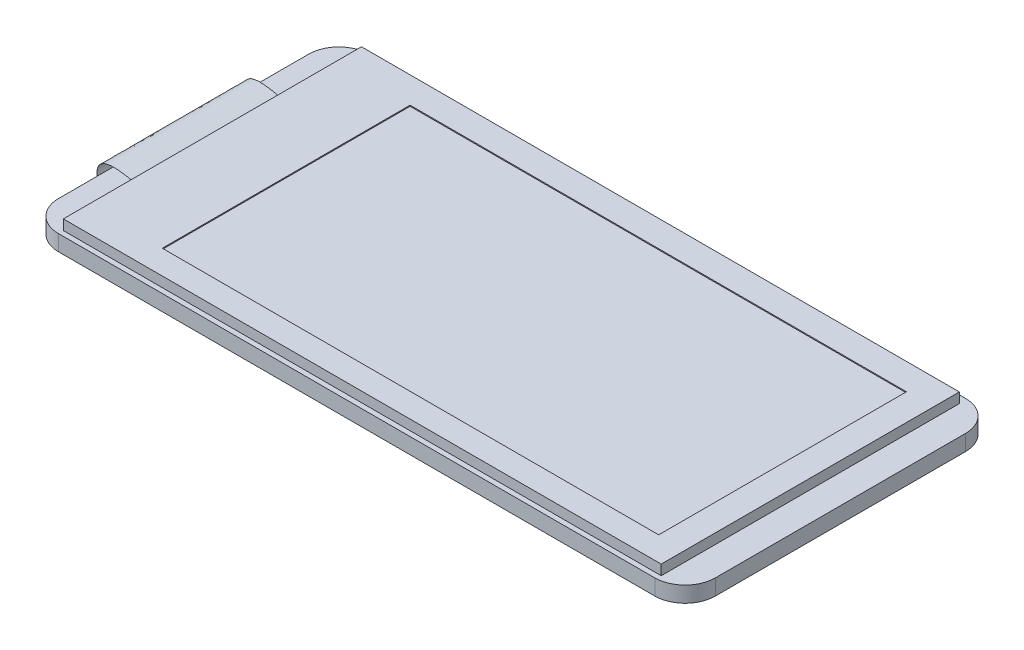
ISO-10303-21;
HEADER;
FILE_DESCRIPTION(('STEP AP214'),'2;1');
FILE_NAME('part.step','',(''),(''),'','','');
FILE_SCHEMA(('AUTOMOTIVE_DESIGN { 1 0 10303 214 1 1 1 1 }'));
ENDSEC;
DATA;
#1=APPLICATION_CONTEXT('core data for automotive mechanical design processes');
#2=APPLICATION_PROTOCOL_DEFINITION('international standard','automotive_design',2000,#1);
#3=PRODUCT_CONTEXT('',#1,'mechanical');
#4=PRODUCT('Part','Part','',(#3));
#5=PRODUCT_RELATED_PRODUCT_CATEGORY('part','',(#4));
#6=PRODUCT_DEFINITION_FORMATION('','',#4);
#7=PRODUCT_DEFINITION_CONTEXT('part definition',#1,'design');
#8=PRODUCT_DEFINITION('design','',#6,#7);
#9=PRODUCT_DEFINITION_SHAPE('','',#8);
#10=(LENGTH_UNIT() NAMED_UNIT(*) SI_UNIT(.MILLI.,.METRE.));
#11=(NAMED_UNIT(*) PLANE_ANGLE_UNIT() SI_UNIT($,.RADIAN.));
#12=(NAMED_UNIT(*) SI_UNIT($,.STERADIAN.) SOLID_ANGLE_UNIT());
#13=UNCERTAINTY_MEASURE_WITH_UNIT(LENGTH_MEASURE(1.E-05),#10,'distance_accuracy_value','');
#14=(GEOMETRIC_REPRESENTATION_CONTEXT(3) GLOBAL_UNCERTAINTY_ASSIGNED_CONTEXT((#13)) GLOBAL_UNIT_ASSIGNED_CONTEXT((#10,
#11,#12)) REPRESENTATION_CONTEXT('',''));
#15=CARTESIAN_POINT('',(0.,0.,0.));
#16=DIRECTION('',(0.,0.,1.));
#17=DIRECTION('',(1.,0.,0.));
#18=AXIS2_PLACEMENT_3D('',#15,#16,#17);
#19=CARTESIAN_POINT('',(-29.52,1.56,-7.125));
#20=CARTESIAN_POINT('',(-33.3668366075532,2.57445468199855,-7.21050303246677));
#21=CARTESIAN_POINT('',(-34.1351251703207,0.0224228326647486,-7.086887013733));
#22=CARTESIAN_POINT('',(-32.5097438643297,-0.863632860500111,-7.12662312440529));
#23=CARTESIAN_POINT('',(-29.5,2.68595234014289E-11,-7.375));
#24=CARTESIAN_POINT('',(-29.52,1.56,-2.29166666666667));
#25=CARTESIAN_POINT('',(-33.3668366075532,2.57445468199855,-2.3650742359035));
#26=CARTESIAN_POINT('',(-34.1351251703207,0.0224228326647486,-2.21368043939195));
#27=CARTESIAN_POINT('',(-32.5097438643297,-0.863632860500111,-2.22563877228647));
#28=CARTESIAN_POINT('',(-29.5,2.68595234014289E-11,-2.45833333333333));
#29=CARTESIAN_POINT('',(-29.52,1.56,2.54166666666666));
#30=CARTESIAN_POINT('',(-33.3668366075532,2.57445468199855,2.48035456065976));
#31=CARTESIAN_POINT('',(-34.1351251703207,0.0224228326647486,2.65952613494909));
#32=CARTESIAN_POINT('',(-32.5097438643297,-0.863632860500111,2.67534557983235));
#33=CARTESIAN_POINT('',(-29.5,2.68595234014289E-11,2.45833333333333));
#34=CARTESIAN_POINT('',(-29.52,1.56,7.375));
#35=CARTESIAN_POINT('',(-33.3668366075532,2.57445468199855,7.32578335722303));
#36=CARTESIAN_POINT('',(-34.1351251703207,0.0224228326647486,7.53273270929013));
#37=CARTESIAN_POINT('',(-32.5097438643297,-0.863632860500111,7.57632993195117));
#38=CARTESIAN_POINT('',(-29.5,2.68595234014289E-11,7.375));
#39=B_SPLINE_SURFACE_WITH_KNOTS('',3,3,((#19,#20,#21,#22,#23),(#24,#25,#26,#27,#28),(#29,#30,
#31,#32,#33),(#34,#35,#36,#37,#38)),.UNSPECIFIED.,.F.,.F.,.F.,(4,4),(4,1,4),(0.,1.),(0.,
0.435436676277593,1.),.UNSPECIFIED.);
#40=DIRECTION('',(0.,0.,1.));
#41=VECTOR('',#40,1.);
#42=CARTESIAN_POINT('',(-29.52,1.56,0.124999999999998));
#43=LINE('',#42,#41);
#44=CARTESIAN_POINT('',(-29.52,1.56,-7.125));
#45=VERTEX_POINT('',#44);
#46=CARTESIAN_POINT('',(-29.52,1.56,7.375));
#47=VERTEX_POINT('',#46);
#48=EDGE_CURVE('E13',#45,#47,#43,.T.);
#49=CARTESIAN_POINT('',(-29.52,1.56,7.375));
#50=CARTESIAN_POINT('',(-33.3668366075532,2.57445468199855,7.32578335722303));
#51=CARTESIAN_POINT('',(-34.1351251703207,0.0224228326647486,7.53273270929013));
#52=CARTESIAN_POINT('',(-32.5097438643297,-0.863632860500111,7.57632993195117));
#53=CARTESIAN_POINT('',(-29.5,2.68595234014289E-11,7.375));
#54=B_SPLINE_CURVE_WITH_KNOTS('',3,(#49,#50,#51,#52,#53),.UNSPECIFIED.,.F.,.F.,(4,1,4),(0.,
0.435436676277593,1.),.UNSPECIFIED.);
#55=CARTESIAN_POINT('',(-29.5,2.68595234014289E-11,7.375));
#56=VERTEX_POINT('',#55);
#57=EDGE_CURVE('E66',#47,#56,#54,.T.);
#58=DIRECTION('',(0.,0.,-1.));
#59=VECTOR('',#58,1.);
#60=CARTESIAN_POINT('',(-29.5,2.68595234014289E-11,0.));
#61=LINE('',#60,#59);
#62=CARTESIAN_POINT('',(-29.5,2.68595234014289E-11,-7.375));
#63=VERTEX_POINT('',#62);
#64=EDGE_CURVE('E60',#56,#63,#61,.T.);
#65=CARTESIAN_POINT('',(-29.52,1.56,-7.125));
#66=CARTESIAN_POINT('',(-33.3668366075532,2.57445468199855,-7.21050303246677));
#67=CARTESIAN_POINT('',(-34.1351251703207,0.0224228326647486,-7.086887013733));
#68=CARTESIAN_POINT('',(-32.5097438643297,-0.863632860500111,-7.12662312440529));
#69=CARTESIAN_POINT('',(-29.5,2.68595234014289E-11,-7.375));
#70=B_SPLINE_CURVE_WITH_KNOTS('',3,(#65,#66,#67,#68,#69),.UNSPECIFIED.,.F.,.F.,(4,1,4),(0.,
0.435436676277593,1.),.UNSPECIFIED.);
#71=EDGE_CURVE('E78',#63,#45,#70,.F.);
#72=ORIENTED_EDGE('',*,*,#48,.T.);
#73=ORIENTED_EDGE('',*,*,#57,.T.);
#74=ORIENTED_EDGE('',*,*,#64,.T.);
#75=ORIENTED_EDGE('',*,*,#71,.T.);
#76=EDGE_LOOP('',(#72,#73,#74,#75));
#77=FACE_BOUND('',#76,.T.);
#78=ADVANCED_FACE('F57',(#77),#39,.T.);
#79=OPEN_SHELL('',(#78));
#80=SHELL_BASED_SURFACE_MODEL('B2',(#79));
#81=CARTESIAN_POINT('',(-29.5,0.,12.375));
#82=DIRECTION('',(0.,1.,0.));
#83=DIRECTION('',(0.,0.,1.));
#84=AXIS2_PLACEMENT_3D('',#81,#82,#83);
#85=PLANE('',#84);
#86=CARTESIAN_POINT('',(-29.5,0.,12.375));
#87=DIRECTION('',(0.,1.,0.));
#88=DIRECTION('',(0.,0.,1.));
#89=AXIS2_PLACEMENT_3D('',#86,#87,#88);
#90=CIRCLE('',#89,3.);
#91=CARTESIAN_POINT('',(-32.5,0.,12.375));
#92=VERTEX_POINT('',#91);
#93=CARTESIAN_POINT('',(-29.5,0.,15.375));
#94=VERTEX_POINT('',#93);
#95=EDGE_CURVE('E355',#92,#94,#90,.T.);
#96=ORIENTED_EDGE('',*,*,#95,.F.);
#97=DIRECTION('',(0.,0.,1.));
#98=VECTOR('',#97,1.);
#99=CARTESIAN_POINT('',(-32.5,0.,-12.375));
#100=LINE('',#99,#98);
#101=CARTESIAN_POINT('',(-32.5,0.,-12.375));
#102=VERTEX_POINT('',#101);
#103=EDGE_CURVE('E360',#102,#92,#100,.T.);
#104=ORIENTED_EDGE('',*,*,#103,.F.);
#105=CARTESIAN_POINT('',(-29.5,0.,-12.375));
#106=DIRECTION('',(0.,1.,0.));
#107=DIRECTION('',(0.,0.,1.));
#108=AXIS2_PLACEMENT_3D('',#105,#106,#107);
#109=CIRCLE('',#108,3.);
#110=CARTESIAN_POINT('',(-29.5,0.,-15.375));
#111=VERTEX_POINT('',#110);
#112=EDGE_CURVE('E387',#111,#102,#109,.T.);
#113=ORIENTED_EDGE('',*,*,#112,.F.);
#114=DIRECTION('',(-1.,0.,0.));
#115=VECTOR('',#114,1.);
#116=CARTESIAN_POINT('',(-29.5,0.,-15.375));
#117=LINE('',#116,#115);
#118=CARTESIAN_POINT('',(29.5,0.,-15.375));
#119=VERTEX_POINT('',#118);
#120=EDGE_CURVE('E385',#119,#111,#117,.T.);
#121=ORIENTED_EDGE('',*,*,#120,.F.);
#122=CARTESIAN_POINT('',(29.5,0.,-12.375));
#123=DIRECTION('',(0.,1.,0.));
#124=DIRECTION('',(0.,0.,-1.));
#125=AXIS2_PLACEMENT_3D('',#122,#123,#124);
#126=CIRCLE('',#125,3.);
#127=CARTESIAN_POINT('',(32.5,0.,-12.375));
#128=VERTEX_POINT('',#127);
#129=EDGE_CURVE('E383',#128,#119,#126,.T.);
#130=ORIENTED_EDGE('',*,*,#129,.F.);
#131=DIRECTION('',(0.,0.,-1.));
#132=VECTOR('',#131,1.);
#133=CARTESIAN_POINT('',(32.5,0.,-12.375));
#134=LINE('',#133,#132);
#135=CARTESIAN_POINT('',(32.5,0.,12.375));
#136=VERTEX_POINT('',#135);
#137=EDGE_CURVE('E381',#136,#128,#134,.T.);
#138=ORIENTED_EDGE('',*,*,#137,.F.);
#139=CARTESIAN_POINT('',(29.5,0.,12.375));
#140=DIRECTION('',(0.,1.,0.));
#141=DIRECTION('',(0.,0.,1.));
#142=AXIS2_PLACEMENT_3D('',#139,#140,#141);
#143=CIRCLE('',#142,3.);
#144=CARTESIAN_POINT('',(29.5,0.,15.375));
#145=VERTEX_POINT('',#144);
#146=EDGE_CURVE('E379',#145,#136,#143,.T.);
#147=ORIENTED_EDGE('',*,*,#146,.F.);
#148=DIRECTION('',(1.,0.,0.));
#149=VECTOR('',#148,1.);
#150=CARTESIAN_POINT('',(-29.5,0.,15.375));
#151=LINE('',#150,#149);
#152=EDGE_CURVE('E377',#94,#145,#151,.T.);
#153=ORIENTED_EDGE('',*,*,#152,.F.);
#154=EDGE_LOOP('',(#96,#104,#113,#121,#130,#138,#147,#153));
#155=FACE_BOUND('',#154,.T.);
#156=DIRECTION('',(0.,0.,-1.));
#157=VECTOR('',#156,1.);
#158=CARTESIAN_POINT('',(-25.7,0.,-8.735));
#159=LINE('',#158,#157);
#160=CARTESIAN_POINT('',(-25.7,0.,-8.735));
#161=VERTEX_POINT('',#160);
#162=CARTESIAN_POINT('',(-25.7,0.,-13.735));
#163=VERTEX_POINT('',#162);
#164=EDGE_CURVE('E289',#161,#163,#159,.T.);
#165=ORIENTED_EDGE('',*,*,#164,.F.);
#166=DIRECTION('',(-1.,0.,0.));
#167=VECTOR('',#166,1.);
#168=CARTESIAN_POINT('',(-25.7,0.,-8.735));
#169=LINE('',#168,#167);
#170=CARTESIAN_POINT('',(25.3,0.,-8.735));
#171=VERTEX_POINT('',#170);
#172=EDGE_CURVE('E297',#171,#161,#169,.T.);
#173=ORIENTED_EDGE('',*,*,#172,.F.);
#174=DIRECTION('',(0.,0.,1.));
#175=VECTOR('',#174,1.);
#176=CARTESIAN_POINT('',(25.3,0.,-8.735));
#177=LINE('',#176,#175);
#178=CARTESIAN_POINT('',(25.3,0.,-13.735));
#179=VERTEX_POINT('',#178);
#180=EDGE_CURVE('E307',#179,#171,#177,.T.);
#181=ORIENTED_EDGE('',*,*,#180,.F.);
#182=DIRECTION('',(1.,0.,0.));
#183=VECTOR('',#182,1.);
#184=CARTESIAN_POINT('',(-25.7,0.,-13.735));
#185=LINE('',#184,#183);
#186=EDGE_CURVE('E140',#163,#179,#185,.T.);
#187=ORIENTED_EDGE('',*,*,#186,.F.);
#188=EDGE_LOOP('',(#165,#173,#181,#187));
#189=FACE_BOUND('',#188,.T.);
#190=ADVANCED_FACE('F117',(#155,#189),#85,.F.);
#191=CARTESIAN_POINT('',(-29.5,1.56,12.375));
#192=DIRECTION('',(0.,-1.,0.));
#193=DIRECTION('',(0.,0.,-1.));
#194=AXIS2_PLACEMENT_3D('',#191,#192,#193);
#195=CYLINDRICAL_SURFACE('',#194,3.);
#196=ORIENTED_EDGE('',*,*,#95,.T.);
#197=DIRECTION('',(0.,-1.,0.));
#198=VECTOR('',#197,1.);
#199=CARTESIAN_POINT('',(-29.5,1.56,15.375));
#200=LINE('',#199,#198);
#201=CARTESIAN_POINT('',(-29.5,1.56,15.375));
#202=VERTEX_POINT('',#201);
#203=EDGE_CURVE('E55',#202,#94,#200,.T.);
#204=ORIENTED_EDGE('',*,*,#203,.F.);
#205=CARTESIAN_POINT('',(-29.5,1.56,12.375));
#206=DIRECTION('',(0.,1.,0.));
#207=DIRECTION('',(0.,0.,1.));
#208=AXIS2_PLACEMENT_3D('',#205,#206,#207);
#209=CIRCLE('',#208,3.);
#210=CARTESIAN_POINT('',(-32.5,1.56,12.375));
#211=VERTEX_POINT('',#210);
#212=EDGE_CURVE('E356',#211,#202,#209,.T.);
#213=ORIENTED_EDGE('',*,*,#212,.F.);
#214=DIRECTION('',(0.,-1.,0.));
#215=VECTOR('',#214,1.);
#216=CARTESIAN_POINT('',(-32.5,1.56,12.375));
#217=LINE('',#216,#215);
#218=EDGE_CURVE('E374',#211,#92,#217,.T.);
#219=ORIENTED_EDGE('',*,*,#218,.T.);
#220=EDGE_LOOP('',(#196,#204,#213,#219));
#221=FACE_BOUND('',#220,.T.);
#222=ADVANCED_FACE('F119',(#221),#195,.T.);
#223=CARTESIAN_POINT('',(-29.5,1.56,15.375));
#224=DIRECTION('',(0.,0.,-1.));
#225=DIRECTION('',(-1.,0.,0.));
#226=AXIS2_PLACEMENT_3D('',#223,#224,#225);
#227=PLANE('',#226);
#228=ORIENTED_EDGE('',*,*,#152,.T.);
#229=DIRECTION('',(0.,-1.,0.));
#230=VECTOR('',#229,1.);
#231=CARTESIAN_POINT('',(29.5,1.56,15.375));
#232=LINE('',#231,#230);
#233=CARTESIAN_POINT('',(29.5,1.56,15.375));
#234=VERTEX_POINT('',#233);
#235=EDGE_CURVE('E125',#234,#145,#232,.T.);
#236=ORIENTED_EDGE('',*,*,#235,.F.);
#237=DIRECTION('',(1.,0.,0.));
#238=VECTOR('',#237,1.);
#239=CARTESIAN_POINT('',(-29.5,1.56,15.375));
#240=LINE('',#239,#238);
#241=EDGE_CURVE('E359',#202,#234,#240,.T.);
#242=ORIENTED_EDGE('',*,*,#241,.F.);
#243=ORIENTED_EDGE('',*,*,#203,.T.);
#244=EDGE_LOOP('',(#228,#236,#242,#243));
#245=FACE_BOUND('',#244,.T.);
#246=ADVANCED_FACE('F433',(#245),#227,.F.);
#247=CARTESIAN_POINT('',(29.5,1.56,12.375));
#248=DIRECTION('',(0.,-1.,0.));
#249=DIRECTION('',(0.,0.,-1.));
#250=AXIS2_PLACEMENT_3D('',#247,#248,#249);
#251=CYLINDRICAL_SURFACE('',#250,3.);
#252=ORIENTED_EDGE('',*,*,#146,.T.);
#253=DIRECTION('',(0.,-1.,0.));
#254=VECTOR('',#253,1.);
#255=CARTESIAN_POINT('',(32.5,1.56,12.375));
#256=LINE('',#255,#254);
#257=CARTESIAN_POINT('',(32.5,1.56,12.375));
#258=VERTEX_POINT('',#257);
#259=EDGE_CURVE('E404',#258,#136,#256,.T.);
#260=ORIENTED_EDGE('',*,*,#259,.F.);
#261=CARTESIAN_POINT('',(29.5,1.56,12.375));
#262=DIRECTION('',(0.,1.,0.));
#263=DIRECTION('',(0.,0.,1.));
#264=AXIS2_PLACEMENT_3D('',#261,#262,#263);
#265=CIRCLE('',#264,3.);
#266=EDGE_CURVE('E362',#234,#258,#265,.T.);
#267=ORIENTED_EDGE('',*,*,#266,.F.);
#268=ORIENTED_EDGE('',*,*,#235,.T.);
#269=EDGE_LOOP('',(#252,#260,#267,#268));
#270=FACE_BOUND('',#269,.T.);
#271=ADVANCED_FACE('F411',(#270),#251,.T.);
#272=CARTESIAN_POINT('',(32.5,1.56,-12.375));
#273=DIRECTION('',(-1.,0.,0.));
#274=DIRECTION('',(0.,0.,1.));
#275=AXIS2_PLACEMENT_3D('',#272,#273,#274);
#276=PLANE('',#275);
#277=ORIENTED_EDGE('',*,*,#137,.T.);
#278=DIRECTION('',(0.,-1.,0.));
#279=VECTOR('',#278,1.);
#280=CARTESIAN_POINT('',(32.5,1.56,-12.375));
#281=LINE('',#280,#279);
#282=CARTESIAN_POINT('',(32.5,1.56,-12.375));
#283=VERTEX_POINT('',#282);
#284=EDGE_CURVE('E401',#283,#128,#281,.T.);
#285=ORIENTED_EDGE('',*,*,#284,.F.);
#286=DIRECTION('',(0.,0.,-1.));
#287=VECTOR('',#286,1.);
#288=CARTESIAN_POINT('',(32.5,1.56,-12.375));
#289=LINE('',#288,#287);
#290=EDGE_CURVE('E364',#258,#283,#289,.T.);
#291=ORIENTED_EDGE('',*,*,#290,.F.);
#292=ORIENTED_EDGE('',*,*,#259,.T.);
#293=EDGE_LOOP('',(#277,#285,#291,#292));
#294=FACE_BOUND('',#293,.T.);
#295=ADVANCED_FACE('F421',(#294),#276,.F.);
#296=CARTESIAN_POINT('',(29.5,1.56,-12.375));
#297=DIRECTION('',(0.,-1.,0.));
#298=DIRECTION('',(0.,0.,-1.));
#299=AXIS2_PLACEMENT_3D('',#296,#297,#298);
#300=CYLINDRICAL_SURFACE('',#299,3.);
#301=ORIENTED_EDGE('',*,*,#129,.T.);
#302=DIRECTION('',(0.,-1.,0.));
#303=VECTOR('',#302,1.);
#304=CARTESIAN_POINT('',(29.5,1.56,-15.375));
#305=LINE('',#304,#303);
#306=CARTESIAN_POINT('',(29.5,1.56,-15.375));
#307=VERTEX_POINT('',#306);
#308=EDGE_CURVE('E398',#307,#119,#305,.T.);
#309=ORIENTED_EDGE('',*,*,#308,.F.);
#310=CARTESIAN_POINT('',(29.5,1.56,-12.375));
#311=DIRECTION('',(0.,1.,0.));
#312=DIRECTION('',(0.,0.,-1.));
#313=AXIS2_PLACEMENT_3D('',#310,#311,#312);
#314=CIRCLE('',#313,3.);
#315=EDGE_CURVE('E366',#283,#307,#314,.T.);
#316=ORIENTED_EDGE('',*,*,#315,.F.);
#317=ORIENTED_EDGE('',*,*,#284,.T.);
#318=EDGE_LOOP('',(#301,#309,#316,#317));
#319=FACE_BOUND('',#318,.T.);
#320=ADVANCED_FACE('F425',(#319),#300,.T.);
#321=CARTESIAN_POINT('',(-29.5,1.56,-15.375));
#322=DIRECTION('',(0.,0.,1.));
#323=DIRECTION('',(1.,0.,0.));
#324=AXIS2_PLACEMENT_3D('',#321,#322,#323);
#325=PLANE('',#324);
#326=ORIENTED_EDGE('',*,*,#120,.T.);
#327=DIRECTION('',(0.,-1.,0.));
#328=VECTOR('',#327,1.);
#329=CARTESIAN_POINT('',(-29.5,1.56,-15.375));
#330=LINE('',#329,#328);
#331=CARTESIAN_POINT('',(-29.5,1.56,-15.375));
#332=VERTEX_POINT('',#331);
#333=EDGE_CURVE('E395',#332,#111,#330,.T.);
#334=ORIENTED_EDGE('',*,*,#333,.F.);
#335=DIRECTION('',(-1.,0.,0.));
#336=VECTOR('',#335,1.);
#337=CARTESIAN_POINT('',(-29.5,1.56,-15.375));
#338=LINE('',#337,#336);
#339=EDGE_CURVE('E368',#307,#332,#338,.T.);
#340=ORIENTED_EDGE('',*,*,#339,.F.);
#341=ORIENTED_EDGE('',*,*,#308,.T.);
#342=EDGE_LOOP('',(#326,#334,#340,#341));
#343=FACE_BOUND('',#342,.T.);
#344=ADVANCED_FACE('F446',(#343),#325,.F.);
#345=CARTESIAN_POINT('',(-29.5,1.56,-12.375));
#346=DIRECTION('',(0.,-1.,0.));
#347=DIRECTION('',(0.,0.,-1.));
#348=AXIS2_PLACEMENT_3D('',#345,#346,#347);
#349=CYLINDRICAL_SURFACE('',#348,3.);
#350=ORIENTED_EDGE('',*,*,#112,.T.);
#351=DIRECTION('',(0.,-1.,0.));
#352=VECTOR('',#351,1.);
#353=CARTESIAN_POINT('',(-32.5,1.56,-12.375));
#354=LINE('',#353,#352);
#355=CARTESIAN_POINT('',(-32.5,1.56,-12.375));
#356=VERTEX_POINT('',#355);
#357=EDGE_CURVE('E392',#356,#102,#354,.T.);
#358=ORIENTED_EDGE('',*,*,#357,.F.);
#359=CARTESIAN_POINT('',(-29.5,1.56,-12.375));
#360=DIRECTION('',(0.,1.,0.));
#361=DIRECTION('',(0.,0.,1.));
#362=AXIS2_PLACEMENT_3D('',#359,#360,#361);
#363=CIRCLE('',#362,3.);
#364=EDGE_CURVE('E370',#332,#356,#363,.T.);
#365=ORIENTED_EDGE('',*,*,#364,.F.);
#366=ORIENTED_EDGE('',*,*,#333,.T.);
#367=EDGE_LOOP('',(#350,#358,#365,#366));
#368=FACE_BOUND('',#367,.T.);
#369=ADVANCED_FACE('F444',(#368),#349,.T.);
#370=CARTESIAN_POINT('',(-32.5,1.56,-12.375));
#371=DIRECTION('',(1.,0.,0.));
#372=DIRECTION('',(0.,0.,-1.));
#373=AXIS2_PLACEMENT_3D('',#370,#371,#372);
#374=PLANE('',#373);
#375=ORIENTED_EDGE('',*,*,#103,.T.);
#376=ORIENTED_EDGE('',*,*,#218,.F.);
#377=DIRECTION('',(0.,0.,1.));
#378=VECTOR('',#377,1.);
#379=CARTESIAN_POINT('',(-32.5,1.56,-12.375));
#380=LINE('',#379,#378);
#381=EDGE_CURVE('E372',#356,#211,#380,.T.);
#382=ORIENTED_EDGE('',*,*,#381,.F.);
#383=ORIENTED_EDGE('',*,*,#357,.T.);
#384=EDGE_LOOP('',(#375,#376,#382,#383));
#385=FACE_BOUND('',#384,.T.);
#386=ADVANCED_FACE('F439',(#385),#374,.F.);
#387=CARTESIAN_POINT('',(-29.5,1.56,12.375));
#388=DIRECTION('',(0.,1.,0.));
#389=DIRECTION('',(0.,0.,1.));
#390=AXIS2_PLACEMENT_3D('',#387,#388,#389);
#391=PLANE('',#390);
#392=DIRECTION('',(0.,0.,1.));
#393=VECTOR('',#392,1.);
#394=CARTESIAN_POINT('',(-29.52,1.56,-14.625));
#395=LINE('',#394,#393);
#396=CARTESIAN_POINT('',(-29.52,1.56,-14.625));
#397=VERTEX_POINT('',#396);
#398=CARTESIAN_POINT('',(-29.52,1.56,14.875));
#399=VERTEX_POINT('',#398);
#400=EDGE_CURVE('E322',#397,#399,#395,.T.);
#401=ORIENTED_EDGE('',*,*,#400,.F.);
#402=DIRECTION('',(-1.,0.,0.));
#403=VECTOR('',#402,1.);
#404=CARTESIAN_POINT('',(-29.52,1.56,-14.625));
#405=LINE('',#404,#403);
#406=CARTESIAN_POINT('',(29.64,1.56,-14.625));
#407=VERTEX_POINT('',#406);
#408=EDGE_CURVE('E327',#407,#397,#405,.T.);
#409=ORIENTED_EDGE('',*,*,#408,.F.);
#410=DIRECTION('',(0.,0.,-1.));
#411=VECTOR('',#410,1.);
#412=CARTESIAN_POINT('',(29.64,1.56,-14.625));
#413=LINE('',#412,#411);
#414=CARTESIAN_POINT('',(29.64,1.56,14.875));
#415=VERTEX_POINT('',#414);
#416=EDGE_CURVE('E339',#415,#407,#413,.T.);
#417=ORIENTED_EDGE('',*,*,#416,.F.);
#418=DIRECTION('',(1.,0.,0.));
#419=VECTOR('',#418,1.);
#420=CARTESIAN_POINT('',(-29.52,1.56,14.875));
#421=LINE('',#420,#419);
#422=EDGE_CURVE('E336',#399,#415,#421,.T.);
#423=ORIENTED_EDGE('',*,*,#422,.F.);
#424=EDGE_LOOP('',(#401,#409,#417,#423));
#425=FACE_BOUND('',#424,.T.);
#426=ORIENTED_EDGE('',*,*,#212,.T.);
#427=ORIENTED_EDGE('',*,*,#241,.T.);
#428=ORIENTED_EDGE('',*,*,#266,.T.);
#429=ORIENTED_EDGE('',*,*,#290,.T.);
#430=ORIENTED_EDGE('',*,*,#315,.T.);
#431=ORIENTED_EDGE('',*,*,#339,.T.);
#432=ORIENTED_EDGE('',*,*,#364,.T.);
#433=ORIENTED_EDGE('',*,*,#381,.T.);
#434=EDGE_LOOP('',(#426,#427,#428,#429,#430,#431,#432,#433));
#435=FACE_BOUND('',#434,.T.);
#436=ADVANCED_FACE('F429',(#425,#435),#391,.T.);
#437=CARTESIAN_POINT('',(-29.52,2.56,-14.625));
#438=DIRECTION('',(1.,0.,0.));
#439=DIRECTION('',(0.,0.,-1.));
#440=AXIS2_PLACEMENT_3D('',#437,#438,#439);
#441=PLANE('',#440);
#442=ORIENTED_EDGE('',*,*,#400,.T.);
#443=DIRECTION('',(0.,-1.,0.));
#444=VECTOR('',#443,1.);
#445=CARTESIAN_POINT('',(-29.52,2.56,14.875));
#446=LINE('',#445,#444);
#447=CARTESIAN_POINT('',(-29.52,2.56,14.875));
#448=VERTEX_POINT('',#447);
#449=EDGE_CURVE('E352',#448,#399,#446,.T.);
#450=ORIENTED_EDGE('',*,*,#449,.F.);
#451=DIRECTION('',(0.,0.,1.));
#452=VECTOR('',#451,1.);
#453=CARTESIAN_POINT('',(-29.52,2.56,-14.625));
#454=LINE('',#453,#452);
#455=CARTESIAN_POINT('',(-29.52,2.56,-14.625));
#456=VERTEX_POINT('',#455);
#457=EDGE_CURVE('E323',#456,#448,#454,.T.);
#458=ORIENTED_EDGE('',*,*,#457,.F.);
#459=DIRECTION('',(0.,-1.,0.));
#460=VECTOR('',#459,1.);
#461=CARTESIAN_POINT('',(-29.52,2.56,-14.625));
#462=LINE('',#461,#460);
#463=EDGE_CURVE('E333',#456,#397,#462,.T.);
#464=ORIENTED_EDGE('',*,*,#463,.T.);
#465=EDGE_LOOP('',(#442,#450,#458,#464));
#466=FACE_BOUND('',#465,.T.);
#467=ADVANCED_FACE('F467',(#466),#441,.F.);
#468=CARTESIAN_POINT('',(-29.52,2.56,14.875));
#469=DIRECTION('',(0.,0.,-1.));
#470=DIRECTION('',(-1.,0.,0.));
#471=AXIS2_PLACEMENT_3D('',#468,#469,#470);
#472=PLANE('',#471);
#473=ORIENTED_EDGE('',*,*,#422,.T.);
#474=DIRECTION('',(0.,-1.,0.));
#475=VECTOR('',#474,1.);
#476=CARTESIAN_POINT('',(29.64,2.56,14.875));
#477=LINE('',#476,#475);
#478=CARTESIAN_POINT('',(29.64,2.56,14.875));
#479=VERTEX_POINT('',#478);
#480=EDGE_CURVE('E349',#479,#415,#477,.T.);
#481=ORIENTED_EDGE('',*,*,#480,.F.);
#482=DIRECTION('',(1.,0.,0.));
#483=VECTOR('',#482,1.);
#484=CARTESIAN_POINT('',(-29.52,2.56,14.875));
#485=LINE('',#484,#483);
#486=EDGE_CURVE('E326',#448,#479,#485,.T.);
#487=ORIENTED_EDGE('',*,*,#486,.F.);
#488=ORIENTED_EDGE('',*,*,#449,.T.);
#489=EDGE_LOOP('',(#473,#481,#487,#488));
#490=FACE_BOUND('',#489,.T.);
#491=ADVANCED_FACE('F472',(#490),#472,.F.);
#492=CARTESIAN_POINT('',(29.64,2.56,-14.625));
#493=DIRECTION('',(-1.,0.,0.));
#494=DIRECTION('',(0.,0.,1.));
#495=AXIS2_PLACEMENT_3D('',#492,#493,#494);
#496=PLANE('',#495);
#497=ORIENTED_EDGE('',*,*,#416,.T.);
#498=DIRECTION('',(0.,-1.,0.));
#499=VECTOR('',#498,1.);
#500=CARTESIAN_POINT('',(29.64,2.56,-14.625));
#501=LINE('',#500,#499);
#502=CARTESIAN_POINT('',(29.64,2.56,-14.625));
#503=VERTEX_POINT('',#502);
#504=EDGE_CURVE('E346',#503,#407,#501,.T.);
#505=ORIENTED_EDGE('',*,*,#504,.F.);
#506=DIRECTION('',(0.,0.,-1.));
#507=VECTOR('',#506,1.);
#508=CARTESIAN_POINT('',(29.64,2.56,-14.625));
#509=LINE('',#508,#507);
#510=EDGE_CURVE('E329',#479,#503,#509,.T.);
#511=ORIENTED_EDGE('',*,*,#510,.F.);
#512=ORIENTED_EDGE('',*,*,#480,.T.);
#513=EDGE_LOOP('',(#497,#505,#511,#512));
#514=FACE_BOUND('',#513,.T.);
#515=ADVANCED_FACE('F486',(#514),#496,.F.);
#516=CARTESIAN_POINT('',(-29.52,2.56,-14.625));
#517=DIRECTION('',(0.,0.,1.));
#518=DIRECTION('',(1.,0.,0.));
#519=AXIS2_PLACEMENT_3D('',#516,#517,#518);
#520=PLANE('',#519);
#521=ORIENTED_EDGE('',*,*,#408,.T.);
#522=ORIENTED_EDGE('',*,*,#463,.F.);
#523=DIRECTION('',(-1.,0.,0.));
#524=VECTOR('',#523,1.);
#525=CARTESIAN_POINT('',(-29.52,2.56,-14.625));
#526=LINE('',#525,#524);
#527=EDGE_CURVE('E331',#503,#456,#526,.T.);
#528=ORIENTED_EDGE('',*,*,#527,.F.);
#529=ORIENTED_EDGE('',*,*,#504,.T.);
#530=EDGE_LOOP('',(#521,#522,#528,#529));
#531=FACE_BOUND('',#530,.T.);
#532=ADVANCED_FACE('F477',(#531),#520,.F.);
#533=CARTESIAN_POINT('',(0.,2.56,0.));
#534=DIRECTION('',(0.,1.,0.));
#535=DIRECTION('',(0.,0.,1.));
#536=AXIS2_PLACEMENT_3D('',#533,#534,#535);
#537=PLANE('',#536);
#538=DIRECTION('',(0.,0.,1.));
#539=VECTOR('',#538,1.);
#540=CARTESIAN_POINT('',(-22.11,2.56,-12.025));
#541=LINE('',#540,#539);
#542=CARTESIAN_POINT('',(-22.11,2.56,-12.025));
#543=VERTEX_POINT('',#542);
#544=CARTESIAN_POINT('',(-22.11,2.56,12.495));
#545=VERTEX_POINT('',#544);
#546=EDGE_CURVE('E132',#543,#545,#541,.T.);
#547=ORIENTED_EDGE('',*,*,#546,.F.);
#548=DIRECTION('',(-1.,0.,0.));
#549=VECTOR('',#548,1.);
#550=CARTESIAN_POINT('',(-22.11,2.56,-12.025));
#551=LINE('',#550,#549);
#552=CARTESIAN_POINT('',(27.01,2.56,-12.025));
#553=VERTEX_POINT('',#552);
#554=EDGE_CURVE('E274',#553,#543,#551,.T.);
#555=ORIENTED_EDGE('',*,*,#554,.F.);
#556=DIRECTION('',(0.,0.,-1.));
#557=VECTOR('',#556,1.);
#558=CARTESIAN_POINT('',(27.01,2.56,-12.025));
#559=LINE('',#558,#557);
#560=CARTESIAN_POINT('',(27.01,2.56,12.495));
#561=VERTEX_POINT('',#560);
#562=EDGE_CURVE('E277',#561,#553,#559,.T.);
#563=ORIENTED_EDGE('',*,*,#562,.F.);
#564=DIRECTION('',(1.,0.,0.));
#565=VECTOR('',#564,1.);
#566=CARTESIAN_POINT('',(-22.11,2.56,12.495));
#567=LINE('',#566,#565);
#568=EDGE_CURVE('E283',#545,#561,#567,.T.);
#569=ORIENTED_EDGE('',*,*,#568,.F.);
#570=EDGE_LOOP('',(#547,#555,#563,#569));
#571=FACE_BOUND('',#570,.T.);
#572=ORIENTED_EDGE('',*,*,#457,.T.);
#573=ORIENTED_EDGE('',*,*,#486,.T.);
#574=ORIENTED_EDGE('',*,*,#510,.T.);
#575=ORIENTED_EDGE('',*,*,#527,.T.);
#576=EDGE_LOOP('',(#572,#573,#574,#575));
#577=FACE_BOUND('',#576,.T.);
#578=ADVANCED_FACE('F482',(#571,#577),#537,.T.);
#579=CARTESIAN_POINT('',(-25.7,-3.68,-8.735));
#580=DIRECTION('',(1.,0.,0.));
#581=DIRECTION('',(0.,0.,-1.));
#582=AXIS2_PLACEMENT_3D('',#579,#580,#581);
#583=PLANE('',#582);
#584=ORIENTED_EDGE('',*,*,#164,.T.);
#585=DIRECTION('',(0.,1.,0.));
#586=VECTOR('',#585,1.);
#587=CARTESIAN_POINT('',(-25.7,-3.68,-13.735));
#588=LINE('',#587,#586);
#589=CARTESIAN_POINT('',(-25.7,-3.68,-13.735));
#590=VERTEX_POINT('',#589);
#591=EDGE_CURVE('E320',#590,#163,#588,.T.);
#592=ORIENTED_EDGE('',*,*,#591,.F.);
#593=DIRECTION('',(0.,0.,-1.));
#594=VECTOR('',#593,1.);
#595=CARTESIAN_POINT('',(-25.7,-3.68,-8.735));
#596=LINE('',#595,#594);
#597=CARTESIAN_POINT('',(-25.7,-3.68,-8.735));
#598=VERTEX_POINT('',#597);
#599=EDGE_CURVE('E293',#598,#590,#596,.T.);
#600=ORIENTED_EDGE('',*,*,#599,.F.);
#601=DIRECTION('',(0.,1.,0.));
#602=VECTOR('',#601,1.);
#603=CARTESIAN_POINT('',(-25.7,-3.68,-8.735));
#604=LINE('',#603,#602);
#605=EDGE_CURVE('E303',#598,#161,#604,.T.);
#606=ORIENTED_EDGE('',*,*,#605,.T.);
#607=EDGE_LOOP('',(#584,#592,#600,#606));
#608=FACE_BOUND('',#607,.T.);
#609=ADVANCED_FACE('F499',(#608),#583,.F.);
#610=CARTESIAN_POINT('',(-25.7,-3.68,-13.735));
#611=DIRECTION('',(0.,0.,1.));
#612=DIRECTION('',(1.,0.,0.));
#613=AXIS2_PLACEMENT_3D('',#610,#611,#612);
#614=PLANE('',#613);
#615=ORIENTED_EDGE('',*,*,#186,.T.);
#616=DIRECTION('',(0.,1.,0.));
#617=VECTOR('',#616,1.);
#618=CARTESIAN_POINT('',(25.3,-3.68,-13.735));
#619=LINE('',#618,#617);
#620=CARTESIAN_POINT('',(25.3,-3.68,-13.735));
#621=VERTEX_POINT('',#620);
#622=EDGE_CURVE('E317',#621,#179,#619,.T.);
#623=ORIENTED_EDGE('',*,*,#622,.F.);
#624=DIRECTION('',(1.,0.,0.));
#625=VECTOR('',#624,1.);
#626=CARTESIAN_POINT('',(-25.7,-3.68,-13.735));
#627=LINE('',#626,#625);
#628=EDGE_CURVE('E296',#590,#621,#627,.T.);
#629=ORIENTED_EDGE('',*,*,#628,.F.);
#630=ORIENTED_EDGE('',*,*,#591,.T.);
#631=EDGE_LOOP('',(#615,#623,#629,#630));
#632=FACE_BOUND('',#631,.T.);
#633=ADVANCED_FACE('F503',(#632),#614,.F.);
#634=CARTESIAN_POINT('',(25.3,-3.68,-8.735));
#635=DIRECTION('',(-1.,0.,0.));
#636=DIRECTION('',(0.,0.,1.));
#637=AXIS2_PLACEMENT_3D('',#634,#635,#636);
#638=PLANE('',#637);
#639=ORIENTED_EDGE('',*,*,#180,.T.);
#640=DIRECTION('',(0.,1.,0.));
#641=VECTOR('',#640,1.);
#642=CARTESIAN_POINT('',(25.3,-3.68,-8.735));
#643=LINE('',#642,#641);
#644=CARTESIAN_POINT('',(25.3,-3.68,-8.735));
#645=VERTEX_POINT('',#644);
#646=EDGE_CURVE('E314',#645,#171,#643,.T.);
#647=ORIENTED_EDGE('',*,*,#646,.F.);
#648=DIRECTION('',(0.,0.,1.));
#649=VECTOR('',#648,1.);
#650=CARTESIAN_POINT('',(25.3,-3.68,-8.735));
#651=LINE('',#650,#649);
#652=EDGE_CURVE('E299',#621,#645,#651,.T.);
#653=ORIENTED_EDGE('',*,*,#652,.F.);
#654=ORIENTED_EDGE('',*,*,#622,.T.);
#655=EDGE_LOOP('',(#639,#647,#653,#654));
#656=FACE_BOUND('',#655,.T.);
#657=ADVANCED_FACE('F507',(#656),#638,.F.);
#658=CARTESIAN_POINT('',(-25.7,-3.68,-8.735));
#659=DIRECTION('',(0.,0.,-1.));
#660=DIRECTION('',(-1.,0.,0.));
#661=AXIS2_PLACEMENT_3D('',#658,#659,#660);
#662=PLANE('',#661);
#663=ORIENTED_EDGE('',*,*,#172,.T.);
#664=ORIENTED_EDGE('',*,*,#605,.F.);
#665=DIRECTION('',(-1.,0.,0.));
#666=VECTOR('',#665,1.);
#667=CARTESIAN_POINT('',(-25.7,-3.68,-8.735));
#668=LINE('',#667,#666);
#669=EDGE_CURVE('E301',#645,#598,#668,.T.);
#670=ORIENTED_EDGE('',*,*,#669,.F.);
#671=ORIENTED_EDGE('',*,*,#646,.T.);
#672=EDGE_LOOP('',(#663,#664,#670,#671));
#673=FACE_BOUND('',#672,.T.);
#674=ADVANCED_FACE('F511',(#673),#662,.F.);
#675=CARTESIAN_POINT('',(0.,-3.68,0.));
#676=DIRECTION('',(0.,-1.,0.));
#677=DIRECTION('',(0.,0.,-1.));
#678=AXIS2_PLACEMENT_3D('',#675,#676,#677);
#679=PLANE('',#678);
#680=ORIENTED_EDGE('',*,*,#599,.T.);
#681=ORIENTED_EDGE('',*,*,#628,.T.);
#682=ORIENTED_EDGE('',*,*,#652,.T.);
#683=ORIENTED_EDGE('',*,*,#669,.T.);
#684=EDGE_LOOP('',(#680,#681,#682,#683));
#685=FACE_BOUND('',#684,.T.);
#686=ADVANCED_FACE('F515',(#685),#679,.T.);
#687=CARTESIAN_POINT('',(-22.11,2.46,-12.025));
#688=DIRECTION('',(-1.,0.,0.));
#689=DIRECTION('',(0.,0.,1.));
#690=AXIS2_PLACEMENT_3D('',#687,#688,#689);
#691=PLANE('',#690);
#692=ORIENTED_EDGE('',*,*,#546,.T.);
#693=DIRECTION('',(0.,1.,0.));
#694=VECTOR('',#693,1.);
#695=CARTESIAN_POINT('',(-22.11,2.46,12.495));
#696=LINE('',#695,#694);
#697=CARTESIAN_POINT('',(-22.11,2.46,12.495));
#698=VERTEX_POINT('',#697);
#699=EDGE_CURVE('E252',#698,#545,#696,.T.);
#700=ORIENTED_EDGE('',*,*,#699,.F.);
#701=DIRECTION('',(0.,0.,1.));
#702=VECTOR('',#701,1.);
#703=CARTESIAN_POINT('',(-22.11,2.46,-12.025));
#704=LINE('',#703,#702);
#705=CARTESIAN_POINT('',(-22.11,2.46,-12.025));
#706=VERTEX_POINT('',#705);
#707=EDGE_CURVE('E256',#706,#698,#704,.T.);
#708=ORIENTED_EDGE('',*,*,#707,.F.);
#709=DIRECTION('',(0.,1.,0.));
#710=VECTOR('',#709,1.);
#711=CARTESIAN_POINT('',(-22.11,2.46,-12.025));
#712=LINE('',#711,#710);
#713=EDGE_CURVE('E287',#706,#543,#712,.T.);
#714=ORIENTED_EDGE('',*,*,#713,.T.);
#715=EDGE_LOOP('',(#692,#700,#708,#714));
#716=FACE_BOUND('',#715,.T.);
#717=ADVANCED_FACE('F254',(#716),#691,.F.);
#718=CARTESIAN_POINT('',(-22.11,2.46,-12.025));
#719=DIRECTION('',(0.,0.,-1.));
#720=DIRECTION('',(-1.,0.,0.));
#721=AXIS2_PLACEMENT_3D('',#718,#719,#720);
#722=PLANE('',#721);
#723=ORIENTED_EDGE('',*,*,#554,.T.);
#724=ORIENTED_EDGE('',*,*,#713,.F.);
#725=DIRECTION('',(-1.,0.,0.));
#726=VECTOR('',#725,1.);
#727=CARTESIAN_POINT('',(-22.11,2.46,-12.025));
#728=LINE('',#727,#726);
#729=CARTESIAN_POINT('',(27.01,2.46,-12.025));
#730=VERTEX_POINT('',#729);
#731=EDGE_CURVE('E262',#730,#706,#728,.T.);
#732=ORIENTED_EDGE('',*,*,#731,.F.);
#733=DIRECTION('',(0.,1.,0.));
#734=VECTOR('',#733,1.);
#735=CARTESIAN_POINT('',(27.01,2.46,-12.025));
#736=LINE('',#735,#734);
#737=EDGE_CURVE('E290',#730,#553,#736,.T.);
#738=ORIENTED_EDGE('',*,*,#737,.T.);
#739=EDGE_LOOP('',(#723,#724,#732,#738));
#740=FACE_BOUND('',#739,.T.);
#741=ADVANCED_FACE('F522',(#740),#722,.F.);
#742=CARTESIAN_POINT('',(27.01,2.46,-12.025));
#743=DIRECTION('',(1.,0.,0.));
#744=DIRECTION('',(0.,0.,-1.));
#745=AXIS2_PLACEMENT_3D('',#742,#743,#744);
#746=PLANE('',#745);
#747=ORIENTED_EDGE('',*,*,#562,.T.);
#748=ORIENTED_EDGE('',*,*,#737,.F.);
#749=DIRECTION('',(0.,0.,-1.));
#750=VECTOR('',#749,1.);
#751=CARTESIAN_POINT('',(27.01,2.46,-12.025));
#752=LINE('',#751,#750);
#753=CARTESIAN_POINT('',(27.01,2.46,12.495));
#754=VERTEX_POINT('',#753);
#755=EDGE_CURVE('E270',#754,#730,#752,.T.);
#756=ORIENTED_EDGE('',*,*,#755,.F.);
#757=DIRECTION('',(0.,1.,0.));
#758=VECTOR('',#757,1.);
#759=CARTESIAN_POINT('',(27.01,2.46,12.495));
#760=LINE('',#759,#758);
#761=EDGE_CURVE('E261',#754,#561,#760,.T.);
#762=ORIENTED_EDGE('',*,*,#761,.T.);
#763=EDGE_LOOP('',(#747,#748,#756,#762));
#764=FACE_BOUND('',#763,.T.);
#765=ADVANCED_FACE('F525',(#764),#746,.F.);
#766=CARTESIAN_POINT('',(-22.11,2.46,12.495));
#767=DIRECTION('',(0.,0.,1.));
#768=DIRECTION('',(1.,0.,0.));
#769=AXIS2_PLACEMENT_3D('',#766,#767,#768);
#770=PLANE('',#769);
#771=ORIENTED_EDGE('',*,*,#568,.T.);
#772=ORIENTED_EDGE('',*,*,#761,.F.);
#773=DIRECTION('',(1.,0.,0.));
#774=VECTOR('',#773,1.);
#775=CARTESIAN_POINT('',(-22.11,2.46,12.495));
#776=LINE('',#775,#774);
#777=EDGE_CURVE('E265',#698,#754,#776,.T.);
#778=ORIENTED_EDGE('',*,*,#777,.F.);
#779=ORIENTED_EDGE('',*,*,#699,.T.);
#780=EDGE_LOOP('',(#771,#772,#778,#779));
#781=FACE_BOUND('',#780,.T.);
#782=ADVANCED_FACE('F266',(#781),#770,.F.);
#783=CARTESIAN_POINT('',(0.,2.46,0.));
#784=DIRECTION('',(0.,1.,0.));
#785=DIRECTION('',(0.,0.,1.));
#786=AXIS2_PLACEMENT_3D('',#783,#784,#785);
#787=PLANE('',#786);
#788=ORIENTED_EDGE('',*,*,#707,.T.);
#789=ORIENTED_EDGE('',*,*,#777,.T.);
#790=ORIENTED_EDGE('',*,*,#755,.T.);
#791=ORIENTED_EDGE('',*,*,#731,.T.);
#792=EDGE_LOOP('',(#788,#789,#790,#791));
#793=FACE_BOUND('',#792,.T.);
#794=ADVANCED_FACE('F272',(#793),#787,.T.);
#795=CLOSED_SHELL('',(#190,#222,#246,#271,#295,#320,#344,#369,#386,#436,#467,#491,#515,#532,
#578,#609,#633,#657,#674,#686,#717,#741,#765,#782,#794));
#796=MANIFOLD_SOLID_BREP('B7',#795);
#797=ADVANCED_BREP_SHAPE_REPRESENTATION('',(#18,#796),#14);
#798=MANIFOLD_SURFACE_SHAPE_REPRESENTATION('',(#18,#80),#14);
#799=SHAPE_REPRESENTATION('',(#18),#14);
#800=SHAPE_DEFINITION_REPRESENTATION(#9,#799);
#801=SHAPE_REPRESENTATION_RELATIONSHIP('','',#799,#797);
#802=SHAPE_REPRESENTATION_RELATIONSHIP('','',#799,#798);
ENDSEC;
END-ISO-10303-21;
